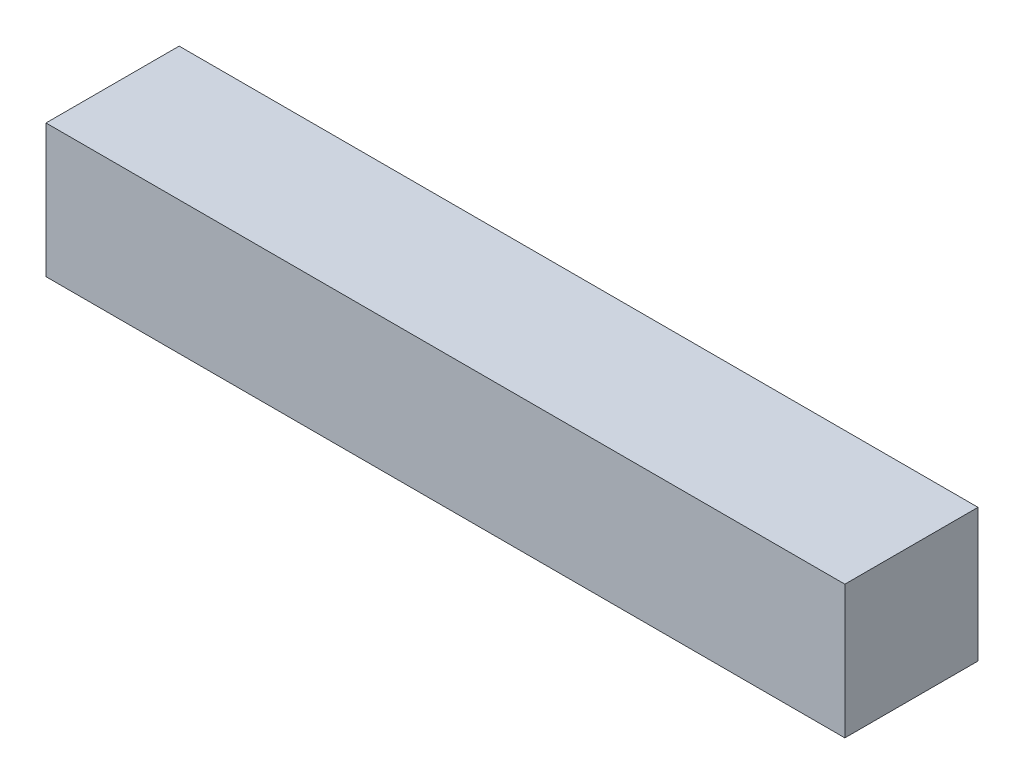
ISO-10303-21;
HEADER;
FILE_DESCRIPTION(('STEP AP214'),'2;1');
FILE_NAME('part.step','',(''),(''),'','','');
FILE_SCHEMA(('AUTOMOTIVE_DESIGN { 1 0 10303 214 1 1 1 1 }'));
ENDSEC;
DATA;
#1=APPLICATION_CONTEXT('core data for automotive mechanical design processes');
#2=APPLICATION_PROTOCOL_DEFINITION('international standard','automotive_design',2000,#1);
#3=PRODUCT_CONTEXT('',#1,'mechanical');
#4=PRODUCT('Part','Part','',(#3));
#5=PRODUCT_RELATED_PRODUCT_CATEGORY('part','',(#4));
#6=PRODUCT_DEFINITION_FORMATION('','',#4);
#7=PRODUCT_DEFINITION_CONTEXT('part definition',#1,'design');
#8=PRODUCT_DEFINITION('design','',#6,#7);
#9=PRODUCT_DEFINITION_SHAPE('','',#8);
#10=(LENGTH_UNIT() NAMED_UNIT(*) SI_UNIT(.MILLI.,.METRE.));
#11=(NAMED_UNIT(*) PLANE_ANGLE_UNIT() SI_UNIT($,.RADIAN.));
#12=(NAMED_UNIT(*) SI_UNIT($,.STERADIAN.) SOLID_ANGLE_UNIT());
#13=UNCERTAINTY_MEASURE_WITH_UNIT(LENGTH_MEASURE(1.E-05),#10,'distance_accuracy_value','');
#14=(GEOMETRIC_REPRESENTATION_CONTEXT(3) GLOBAL_UNCERTAINTY_ASSIGNED_CONTEXT((#13)) GLOBAL_UNIT_ASSIGNED_CONTEXT((#10,
#11,#12)) REPRESENTATION_CONTEXT('',''));
#15=CARTESIAN_POINT('',(0.,0.,0.));
#16=DIRECTION('',(0.,0.,1.));
#17=DIRECTION('',(1.,0.,0.));
#18=AXIS2_PLACEMENT_3D('',#15,#16,#17);
#19=CARTESIAN_POINT('',(152.4,0.,0.));
#20=DIRECTION('',(0.,0.,-1.));
#21=DIRECTION('',(0.,1.,0.));
#22=AXIS2_PLACEMENT_3D('',#19,#20,#21);
#23=PLANE('',#22);
#24=DIRECTION('',(0.,-1.,0.));
#25=VECTOR('',#24,1.);
#26=CARTESIAN_POINT('',(0.,0.,0.));
#27=LINE('',#26,#25);
#28=CARTESIAN_POINT('',(0.,25.4,0.));
#29=VERTEX_POINT('',#28);
#30=CARTESIAN_POINT('',(0.,0.,0.));
#31=VERTEX_POINT('',#30);
#32=EDGE_CURVE('E95',#29,#31,#27,.T.);
#33=ORIENTED_EDGE('',*,*,#32,.T.);
#34=DIRECTION('',(-1.,0.,0.));
#35=VECTOR('',#34,1.);
#36=CARTESIAN_POINT('',(152.4,0.,0.));
#37=LINE('',#36,#35);
#38=CARTESIAN_POINT('',(152.4,0.,0.));
#39=VERTEX_POINT('',#38);
#40=EDGE_CURVE('E11',#39,#31,#37,.T.);
#41=ORIENTED_EDGE('',*,*,#40,.F.);
#42=DIRECTION('',(0.,-1.,0.));
#43=VECTOR('',#42,1.);
#44=CARTESIAN_POINT('',(152.4,0.,0.));
#45=LINE('',#44,#43);
#46=CARTESIAN_POINT('',(152.4,25.4,0.));
#47=VERTEX_POINT('',#46);
#48=EDGE_CURVE('E83',#47,#39,#45,.T.);
#49=ORIENTED_EDGE('',*,*,#48,.F.);
#50=DIRECTION('',(-1.,0.,0.));
#51=VECTOR('',#50,1.);
#52=CARTESIAN_POINT('',(152.4,25.4,0.));
#53=LINE('',#52,#51);
#54=EDGE_CURVE('E91',#47,#29,#53,.T.);
#55=ORIENTED_EDGE('',*,*,#54,.T.);
#56=EDGE_LOOP('',(#33,#41,#49,#55));
#57=FACE_BOUND('',#56,.T.);
#58=ADVANCED_FACE('F32',(#57),#23,.F.);
#59=CARTESIAN_POINT('',(152.4,0.,0.));
#60=DIRECTION('',(0.,1.,0.));
#61=DIRECTION('',(0.,0.,1.));
#62=AXIS2_PLACEMENT_3D('',#59,#60,#61);
#63=PLANE('',#62);
#64=DIRECTION('',(0.,0.,-1.));
#65=VECTOR('',#64,1.);
#66=CARTESIAN_POINT('',(0.,0.,0.));
#67=LINE('',#66,#65);
#68=CARTESIAN_POINT('',(0.,0.,-25.4));
#69=VERTEX_POINT('',#68);
#70=EDGE_CURVE('E87',#31,#69,#67,.T.);
#71=ORIENTED_EDGE('',*,*,#70,.T.);
#72=DIRECTION('',(-1.,0.,0.));
#73=VECTOR('',#72,1.);
#74=CARTESIAN_POINT('',(152.4,0.,-25.4));
#75=LINE('',#74,#73);
#76=CARTESIAN_POINT('',(152.4,0.,-25.4));
#77=VERTEX_POINT('',#76);
#78=EDGE_CURVE('E40',#77,#69,#75,.T.);
#79=ORIENTED_EDGE('',*,*,#78,.F.);
#80=DIRECTION('',(0.,0.,-1.));
#81=VECTOR('',#80,1.);
#82=CARTESIAN_POINT('',(152.4,0.,0.));
#83=LINE('',#82,#81);
#84=EDGE_CURVE('E78',#39,#77,#83,.T.);
#85=ORIENTED_EDGE('',*,*,#84,.F.);
#86=ORIENTED_EDGE('',*,*,#40,.T.);
#87=EDGE_LOOP('',(#71,#79,#85,#86));
#88=FACE_BOUND('',#87,.T.);
#89=ADVANCED_FACE('F86',(#88),#63,.F.);
#90=CARTESIAN_POINT('',(152.4,0.,-25.4));
#91=DIRECTION('',(0.,0.,1.));
#92=DIRECTION('',(0.,-1.,0.));
#93=AXIS2_PLACEMENT_3D('',#90,#91,#92);
#94=PLANE('',#93);
#95=DIRECTION('',(0.,1.,0.));
#96=VECTOR('',#95,1.);
#97=CARTESIAN_POINT('',(0.,0.,-25.4));
#98=LINE('',#97,#96);
#99=CARTESIAN_POINT('',(0.,25.4,-25.4));
#100=VERTEX_POINT('',#99);
#101=EDGE_CURVE('E65',#69,#100,#98,.T.);
#102=ORIENTED_EDGE('',*,*,#101,.T.);
#103=DIRECTION('',(-1.,0.,0.));
#104=VECTOR('',#103,1.);
#105=CARTESIAN_POINT('',(152.4,25.4,-25.4));
#106=LINE('',#105,#104);
#107=CARTESIAN_POINT('',(152.4,25.4,-25.4));
#108=VERTEX_POINT('',#107);
#109=EDGE_CURVE('E88',#108,#100,#106,.T.);
#110=ORIENTED_EDGE('',*,*,#109,.F.);
#111=DIRECTION('',(0.,1.,0.));
#112=VECTOR('',#111,1.);
#113=CARTESIAN_POINT('',(152.4,0.,-25.4));
#114=LINE('',#113,#112);
#115=EDGE_CURVE('E81',#77,#108,#114,.T.);
#116=ORIENTED_EDGE('',*,*,#115,.F.);
#117=ORIENTED_EDGE('',*,*,#78,.T.);
#118=EDGE_LOOP('',(#102,#110,#116,#117));
#119=FACE_BOUND('',#118,.T.);
#120=ADVANCED_FACE('F89',(#119),#94,.F.);
#121=CARTESIAN_POINT('',(152.4,25.4,0.));
#122=DIRECTION('',(0.,-1.,0.));
#123=DIRECTION('',(0.,0.,-1.));
#124=AXIS2_PLACEMENT_3D('',#121,#122,#123);
#125=PLANE('',#124);
#126=DIRECTION('',(0.,0.,1.));
#127=VECTOR('',#126,1.);
#128=CARTESIAN_POINT('',(0.,25.4,0.));
#129=LINE('',#128,#127);
#130=EDGE_CURVE('E71',#100,#29,#129,.T.);
#131=ORIENTED_EDGE('',*,*,#130,.T.);
#132=ORIENTED_EDGE('',*,*,#54,.F.);
#133=DIRECTION('',(0.,0.,1.));
#134=VECTOR('',#133,1.);
#135=CARTESIAN_POINT('',(152.4,25.4,0.));
#136=LINE('',#135,#134);
#137=EDGE_CURVE('E48',#108,#47,#136,.T.);
#138=ORIENTED_EDGE('',*,*,#137,.F.);
#139=ORIENTED_EDGE('',*,*,#109,.T.);
#140=EDGE_LOOP('',(#131,#132,#138,#139));
#141=FACE_BOUND('',#140,.T.);
#142=ADVANCED_FACE('F102',(#141),#125,.F.);
#143=CARTESIAN_POINT('',(152.4,0.,0.));
#144=DIRECTION('',(-1.,0.,0.));
#145=DIRECTION('',(0.,0.,1.));
#146=AXIS2_PLACEMENT_3D('',#143,#144,#145);
#147=PLANE('',#146);
#148=ORIENTED_EDGE('',*,*,#48,.T.);
#149=ORIENTED_EDGE('',*,*,#84,.T.);
#150=ORIENTED_EDGE('',*,*,#115,.T.);
#151=ORIENTED_EDGE('',*,*,#137,.T.);
#152=EDGE_LOOP('',(#148,#149,#150,#151));
#153=FACE_BOUND('',#152,.T.);
#154=ADVANCED_FACE('F79',(#153),#147,.F.);
#155=CARTESIAN_POINT('',(0.,0.,0.));
#156=DIRECTION('',(-1.,0.,0.));
#157=DIRECTION('',(0.,0.,1.));
#158=AXIS2_PLACEMENT_3D('',#155,#156,#157);
#159=PLANE('',#158);
#160=ORIENTED_EDGE('',*,*,#32,.F.);
#161=ORIENTED_EDGE('',*,*,#130,.F.);
#162=ORIENTED_EDGE('',*,*,#101,.F.);
#163=ORIENTED_EDGE('',*,*,#70,.F.);
#164=EDGE_LOOP('',(#160,#161,#162,#163));
#165=FACE_BOUND('',#164,.T.);
#166=ADVANCED_FACE('F105',(#165),#159,.T.);
#167=CLOSED_SHELL('',(#58,#89,#120,#142,#154,#166));
#168=MANIFOLD_SOLID_BREP('B2',#167);
#169=ADVANCED_BREP_SHAPE_REPRESENTATION('',(#18,#168),#14);
#170=SHAPE_DEFINITION_REPRESENTATION(#9,#169);
ENDSEC;
END-ISO-10303-21;
